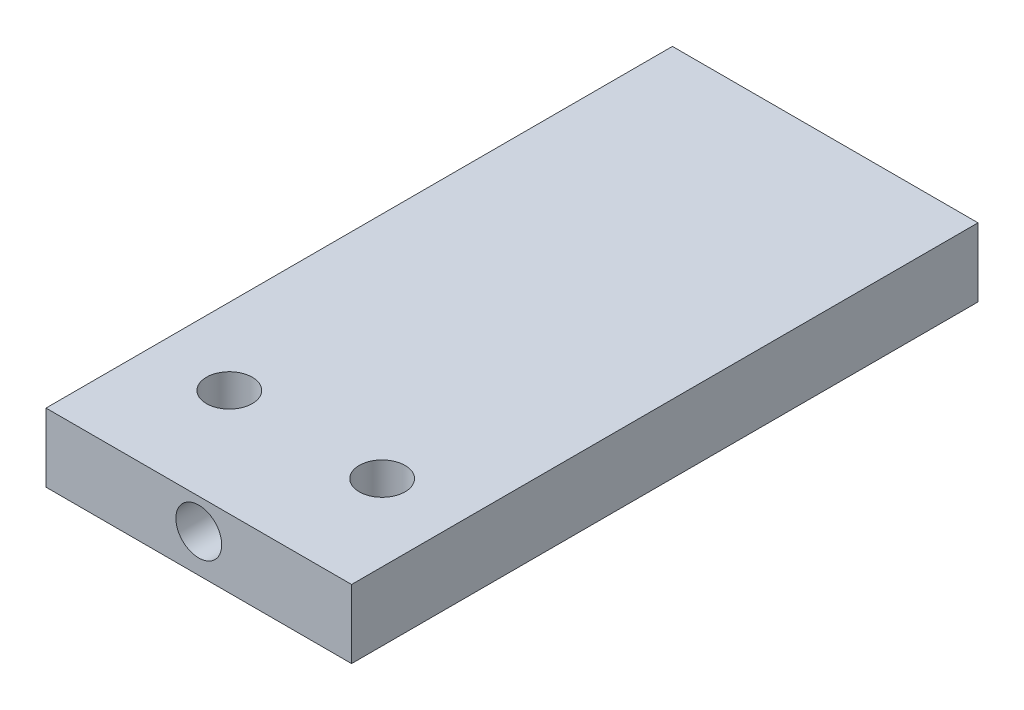
ISO-10303-21;
HEADER;
FILE_DESCRIPTION(('STEP AP214'),'2;1');
FILE_NAME('part.step','',(''),(''),'','','');
FILE_SCHEMA(('AUTOMOTIVE_DESIGN { 1 0 10303 214 1 1 1 1 }'));
ENDSEC;
DATA;
#1=APPLICATION_CONTEXT('core data for automotive mechanical design processes');
#2=APPLICATION_PROTOCOL_DEFINITION('international standard','automotive_design',2000,#1);
#3=PRODUCT_CONTEXT('',#1,'mechanical');
#4=PRODUCT('Part','Part','',(#3));
#5=PRODUCT_RELATED_PRODUCT_CATEGORY('part','',(#4));
#6=PRODUCT_DEFINITION_FORMATION('','',#4);
#7=PRODUCT_DEFINITION_CONTEXT('part definition',#1,'design');
#8=PRODUCT_DEFINITION('design','',#6,#7);
#9=PRODUCT_DEFINITION_SHAPE('','',#8);
#10=(LENGTH_UNIT() NAMED_UNIT(*) SI_UNIT(.MILLI.,.METRE.));
#11=(NAMED_UNIT(*) PLANE_ANGLE_UNIT() SI_UNIT($,.RADIAN.));
#12=(NAMED_UNIT(*) SI_UNIT($,.STERADIAN.) SOLID_ANGLE_UNIT());
#13=UNCERTAINTY_MEASURE_WITH_UNIT(LENGTH_MEASURE(1.E-05),#10,'distance_accuracy_value','');
#14=(GEOMETRIC_REPRESENTATION_CONTEXT(3) GLOBAL_UNCERTAINTY_ASSIGNED_CONTEXT((#13)) GLOBAL_UNIT_ASSIGNED_CONTEXT((#10,
#11,#12)) REPRESENTATION_CONTEXT('',''));
#15=CARTESIAN_POINT('',(0.,0.,0.));
#16=DIRECTION('',(0.,0.,1.));
#17=DIRECTION('',(1.,0.,0.));
#18=AXIS2_PLACEMENT_3D('',#15,#16,#17);
#19=CARTESIAN_POINT('',(0.,0.,-41.));
#20=DIRECTION('',(-1.,0.,0.));
#21=DIRECTION('',(0.,0.,1.));
#22=AXIS2_PLACEMENT_3D('',#19,#20,#21);
#23=PLANE('',#22);
#24=DIRECTION('',(0.,0.,1.));
#25=VECTOR('',#24,1.);
#26=CARTESIAN_POINT('',(0.,3.814,-30.75));
#27=LINE('',#26,#25);
#28=CARTESIAN_POINT('',(0.,3.814,-41.));
#29=VERTEX_POINT('',#28);
#30=CARTESIAN_POINT('',(0.,3.814,0.));
#31=VERTEX_POINT('',#30);
#32=EDGE_CURVE('E111',#29,#31,#27,.T.);
#33=ORIENTED_EDGE('',*,*,#32,.T.);
#34=DIRECTION('',(0.,1.,0.));
#35=VECTOR('',#34,1.);
#36=CARTESIAN_POINT('',(0.,0.,0.));
#37=LINE('',#36,#35);
#38=CARTESIAN_POINT('',(0.,8.3,0.));
#39=VERTEX_POINT('',#38);
#40=EDGE_CURVE('E10',#31,#39,#37,.T.);
#41=ORIENTED_EDGE('',*,*,#40,.T.);
#42=DIRECTION('',(0.,0.,1.));
#43=VECTOR('',#42,1.);
#44=CARTESIAN_POINT('',(0.,8.3,-41.));
#45=LINE('',#44,#43);
#46=CARTESIAN_POINT('',(0.,8.3,-41.));
#47=VERTEX_POINT('',#46);
#48=EDGE_CURVE('E146',#47,#39,#45,.T.);
#49=ORIENTED_EDGE('',*,*,#48,.F.);
#50=DIRECTION('',(0.,1.,0.));
#51=VECTOR('',#50,1.);
#52=CARTESIAN_POINT('',(0.,0.,-41.));
#53=LINE('',#52,#51);
#54=EDGE_CURVE('E113',#29,#47,#53,.T.);
#55=ORIENTED_EDGE('',*,*,#54,.F.);
#56=EDGE_LOOP('',(#33,#41,#49,#55));
#57=FACE_BOUND('',#56,.T.);
#58=ADVANCED_FACE('F15',(#57),#23,.T.);
#59=CARTESIAN_POINT('',(0.,0.,0.));
#60=DIRECTION('',(0.,0.,1.));
#61=DIRECTION('',(1.,0.,0.));
#62=AXIS2_PLACEMENT_3D('',#59,#60,#61);
#63=PLANE('',#62);
#64=CARTESIAN_POINT('',(10.,6.3,0.));
#65=DIRECTION('',(0.,0.,-1.));
#66=DIRECTION('',(1.,0.,0.));
#67=AXIS2_PLACEMENT_3D('',#64,#65,#66);
#68=CIRCLE('',#67,1.5);
#69=CARTESIAN_POINT('',(8.5,6.3,0.));
#70=VERTEX_POINT('',#69);
#71=EDGE_CURVE('E164',#70,#70,#68,.T.);
#72=ORIENTED_EDGE('',*,*,#71,.T.);
#73=EDGE_LOOP('',(#72));
#74=FACE_BOUND('',#73,.T.);
#75=DIRECTION('',(1.,0.,0.));
#76=VECTOR('',#75,1.);
#77=CARTESIAN_POINT('',(5.,3.814,0.));
#78=LINE('',#77,#76);
#79=CARTESIAN_POINT('',(20.,3.814,0.));
#80=VERTEX_POINT('',#79);
#81=EDGE_CURVE('E105',#31,#80,#78,.T.);
#82=ORIENTED_EDGE('',*,*,#81,.T.);
#83=DIRECTION('',(0.,1.,0.));
#84=VECTOR('',#83,1.);
#85=CARTESIAN_POINT('',(20.,0.,0.));
#86=LINE('',#85,#84);
#87=CARTESIAN_POINT('',(20.,8.3,0.));
#88=VERTEX_POINT('',#87);
#89=EDGE_CURVE('E140',#80,#88,#86,.T.);
#90=ORIENTED_EDGE('',*,*,#89,.T.);
#91=DIRECTION('',(1.,0.,0.));
#92=VECTOR('',#91,1.);
#93=CARTESIAN_POINT('',(0.,8.3,0.));
#94=LINE('',#93,#92);
#95=EDGE_CURVE('E107',#39,#88,#94,.T.);
#96=ORIENTED_EDGE('',*,*,#95,.F.);
#97=ORIENTED_EDGE('',*,*,#40,.F.);
#98=EDGE_LOOP('',(#82,#90,#96,#97));
#99=FACE_BOUND('',#98,.T.);
#100=ADVANCED_FACE('F102',(#74,#99),#63,.T.);
#101=CARTESIAN_POINT('',(5.,0.,-7.));
#102=DIRECTION('',(0.,1.,0.));
#103=DIRECTION('',(1.,0.,0.));
#104=AXIS2_PLACEMENT_3D('',#101,#102,#103);
#105=CYLINDRICAL_SURFACE('',#104,1.5);
#106=CARTESIAN_POINT('',(5.,8.3,-7.));
#107=DIRECTION('',(0.,-1.,0.));
#108=DIRECTION('',(1.,0.,0.));
#109=AXIS2_PLACEMENT_3D('',#106,#107,#108);
#110=CIRCLE('',#109,1.5);
#111=CARTESIAN_POINT('',(3.5,8.3,-7.));
#112=VERTEX_POINT('',#111);
#113=EDGE_CURVE('E145',#112,#112,#110,.T.);
#114=ORIENTED_EDGE('',*,*,#113,.F.);
#115=DIRECTION('',(0.,-1.,0.));
#116=VECTOR('',#115,1.);
#117=CARTESIAN_POINT('',(3.5,0.,-7.));
#118=LINE('',#117,#116);
#119=CARTESIAN_POINT('',(3.5,3.814,-7.));
#120=VERTEX_POINT('',#119);
#121=EDGE_CURVE('E19',#112,#120,#118,.T.);
#122=ORIENTED_EDGE('',*,*,#121,.T.);
#123=CARTESIAN_POINT('',(5.,3.814,-7.));
#124=DIRECTION('',(0.,-1.,0.));
#125=DIRECTION('',(1.,0.,0.));
#126=AXIS2_PLACEMENT_3D('',#123,#124,#125);
#127=CIRCLE('',#126,1.5);
#128=EDGE_CURVE('E118',#120,#120,#127,.T.);
#129=ORIENTED_EDGE('',*,*,#128,.T.);
#130=ORIENTED_EDGE('',*,*,#121,.F.);
#131=EDGE_LOOP('',(#114,#122,#129,#130));
#132=FACE_BOUND('',#131,.T.);
#133=ADVANCED_FACE('F208',(#132),#105,.F.);
#134=CARTESIAN_POINT('',(15.,0.,-7.));
#135=DIRECTION('',(0.,1.,0.));
#136=DIRECTION('',(1.,0.,0.));
#137=AXIS2_PLACEMENT_3D('',#134,#135,#136);
#138=CYLINDRICAL_SURFACE('',#137,1.5);
#139=CARTESIAN_POINT('',(15.,8.3,-7.));
#140=DIRECTION('',(0.,-1.,0.));
#141=DIRECTION('',(1.,0.,0.));
#142=AXIS2_PLACEMENT_3D('',#139,#140,#141);
#143=CIRCLE('',#142,1.5);
#144=CARTESIAN_POINT('',(13.5,8.3,-7.));
#145=VERTEX_POINT('',#144);
#146=EDGE_CURVE('E149',#145,#145,#143,.T.);
#147=ORIENTED_EDGE('',*,*,#146,.F.);
#148=DIRECTION('',(0.,-1.,0.));
#149=VECTOR('',#148,1.);
#150=CARTESIAN_POINT('',(13.5,0.,-7.));
#151=LINE('',#150,#149);
#152=CARTESIAN_POINT('',(13.5,3.814,-7.));
#153=VERTEX_POINT('',#152);
#154=EDGE_CURVE('E39',#145,#153,#151,.T.);
#155=ORIENTED_EDGE('',*,*,#154,.T.);
#156=CARTESIAN_POINT('',(15.,3.814,-7.));
#157=DIRECTION('',(0.,-1.,0.));
#158=DIRECTION('',(1.,0.,0.));
#159=AXIS2_PLACEMENT_3D('',#156,#157,#158);
#160=CIRCLE('',#159,1.5);
#161=EDGE_CURVE('E138',#153,#153,#160,.T.);
#162=ORIENTED_EDGE('',*,*,#161,.T.);
#163=ORIENTED_EDGE('',*,*,#154,.F.);
#164=EDGE_LOOP('',(#147,#155,#162,#163));
#165=FACE_BOUND('',#164,.T.);
#166=ADVANCED_FACE('F225',(#165),#138,.F.);
#167=CARTESIAN_POINT('',(10.,8.3,-20.5));
#168=DIRECTION('',(0.,1.,0.));
#169=DIRECTION('',(1.,0.,0.));
#170=AXIS2_PLACEMENT_3D('',#167,#168,#169);
#171=PLANE('',#170);
#172=ORIENTED_EDGE('',*,*,#146,.T.);
#173=EDGE_LOOP('',(#172));
#174=FACE_BOUND('',#173,.T.);
#175=ORIENTED_EDGE('',*,*,#113,.T.);
#176=EDGE_LOOP('',(#175));
#177=FACE_BOUND('',#176,.T.);
#178=DIRECTION('',(-1.,0.,0.));
#179=VECTOR('',#178,1.);
#180=CARTESIAN_POINT('',(20.,8.3,-41.));
#181=LINE('',#180,#179);
#182=CARTESIAN_POINT('',(20.,8.3,-41.));
#183=VERTEX_POINT('',#182);
#184=EDGE_CURVE('E132',#183,#47,#181,.T.);
#185=ORIENTED_EDGE('',*,*,#184,.T.);
#186=ORIENTED_EDGE('',*,*,#48,.T.);
#187=ORIENTED_EDGE('',*,*,#95,.T.);
#188=DIRECTION('',(0.,0.,-1.));
#189=VECTOR('',#188,1.);
#190=CARTESIAN_POINT('',(20.,8.3,-7.));
#191=LINE('',#190,#189);
#192=EDGE_CURVE('E137',#88,#183,#191,.T.);
#193=ORIENTED_EDGE('',*,*,#192,.T.);
#194=EDGE_LOOP('',(#185,#186,#187,#193));
#195=FACE_BOUND('',#194,.T.);
#196=ADVANCED_FACE('F230',(#174,#177,#195),#171,.T.);
#197=CARTESIAN_POINT('',(10.,6.3,0.));
#198=DIRECTION('',(0.,0.,-1.));
#199=DIRECTION('',(1.,0.,0.));
#200=AXIS2_PLACEMENT_3D('',#197,#198,#199);
#201=CYLINDRICAL_SURFACE('',#200,1.5);
#202=ORIENTED_EDGE('',*,*,#71,.F.);
#203=DIRECTION('',(0.,0.,-1.));
#204=VECTOR('',#203,1.);
#205=CARTESIAN_POINT('',(8.5,6.3,0.));
#206=LINE('',#205,#204);
#207=CARTESIAN_POINT('',(8.5,6.3,-41.));
#208=VERTEX_POINT('',#207);
#209=EDGE_CURVE('E71',#70,#208,#206,.T.);
#210=ORIENTED_EDGE('',*,*,#209,.T.);
#211=CARTESIAN_POINT('',(10.,6.3,-41.));
#212=DIRECTION('',(0.,0.,1.));
#213=DIRECTION('',(1.,0.,0.));
#214=AXIS2_PLACEMENT_3D('',#211,#212,#213);
#215=CIRCLE('',#214,1.5);
#216=EDGE_CURVE('E160',#208,#208,#215,.T.);
#217=ORIENTED_EDGE('',*,*,#216,.F.);
#218=ORIENTED_EDGE('',*,*,#209,.F.);
#219=EDGE_LOOP('',(#202,#210,#217,#218));
#220=FACE_BOUND('',#219,.T.);
#221=ADVANCED_FACE('F192',(#220),#201,.F.);
#222=CARTESIAN_POINT('',(20.,0.,-41.));
#223=DIRECTION('',(0.,0.,-1.));
#224=DIRECTION('',(0.,-1.,0.));
#225=AXIS2_PLACEMENT_3D('',#222,#223,#224);
#226=PLANE('',#225);
#227=ORIENTED_EDGE('',*,*,#216,.T.);
#228=EDGE_LOOP('',(#227));
#229=FACE_BOUND('',#228,.T.);
#230=DIRECTION('',(-1.,0.,0.));
#231=VECTOR('',#230,1.);
#232=CARTESIAN_POINT('',(15.,3.814,-41.));
#233=LINE('',#232,#231);
#234=CARTESIAN_POINT('',(20.,3.814,-41.));
#235=VERTEX_POINT('',#234);
#236=EDGE_CURVE('E128',#235,#29,#233,.T.);
#237=ORIENTED_EDGE('',*,*,#236,.T.);
#238=ORIENTED_EDGE('',*,*,#54,.T.);
#239=ORIENTED_EDGE('',*,*,#184,.F.);
#240=DIRECTION('',(0.,1.,0.));
#241=VECTOR('',#240,1.);
#242=CARTESIAN_POINT('',(20.,0.,-41.));
#243=LINE('',#242,#241);
#244=EDGE_CURVE('E134',#235,#183,#243,.T.);
#245=ORIENTED_EDGE('',*,*,#244,.F.);
#246=EDGE_LOOP('',(#237,#238,#239,#245));
#247=FACE_BOUND('',#246,.T.);
#248=ADVANCED_FACE('F17',(#229,#247),#226,.T.);
#249=CARTESIAN_POINT('',(20.,0.,0.));
#250=DIRECTION('',(1.,0.,0.));
#251=DIRECTION('',(0.,1.,0.));
#252=AXIS2_PLACEMENT_3D('',#249,#250,#251);
#253=PLANE('',#252);
#254=DIRECTION('',(0.,0.,-1.));
#255=VECTOR('',#254,1.);
#256=CARTESIAN_POINT('',(20.,3.814,-10.25));
#257=LINE('',#256,#255);
#258=EDGE_CURVE('E121',#80,#235,#257,.T.);
#259=ORIENTED_EDGE('',*,*,#258,.T.);
#260=ORIENTED_EDGE('',*,*,#244,.T.);
#261=ORIENTED_EDGE('',*,*,#192,.F.);
#262=ORIENTED_EDGE('',*,*,#89,.F.);
#263=EDGE_LOOP('',(#259,#260,#261,#262));
#264=FACE_BOUND('',#263,.T.);
#265=ADVANCED_FACE('F191',(#264),#253,.T.);
#266=CARTESIAN_POINT('',(10.,3.814,-20.5));
#267=DIRECTION('',(0.,1.,0.));
#268=DIRECTION('',(1.,0.,0.));
#269=AXIS2_PLACEMENT_3D('',#266,#267,#268);
#270=PLANE('',#269);
#271=ORIENTED_EDGE('',*,*,#161,.F.);
#272=EDGE_LOOP('',(#271));
#273=FACE_BOUND('',#272,.T.);
#274=ORIENTED_EDGE('',*,*,#128,.F.);
#275=EDGE_LOOP('',(#274));
#276=FACE_BOUND('',#275,.T.);
#277=ORIENTED_EDGE('',*,*,#236,.F.);
#278=ORIENTED_EDGE('',*,*,#258,.F.);
#279=ORIENTED_EDGE('',*,*,#81,.F.);
#280=ORIENTED_EDGE('',*,*,#32,.F.);
#281=EDGE_LOOP('',(#277,#278,#279,#280));
#282=FACE_BOUND('',#281,.T.);
#283=ADVANCED_FACE('F119',(#273,#276,#282),#270,.F.);
#284=CLOSED_SHELL('',(#58,#100,#133,#166,#196,#221,#248,#265,#283));
#285=MANIFOLD_SOLID_BREP('B1',#284);
#286=ADVANCED_BREP_SHAPE_REPRESENTATION('',(#18,#285),#14);
#287=SHAPE_DEFINITION_REPRESENTATION(#9,#286);
ENDSEC;
END-ISO-10303-21;
